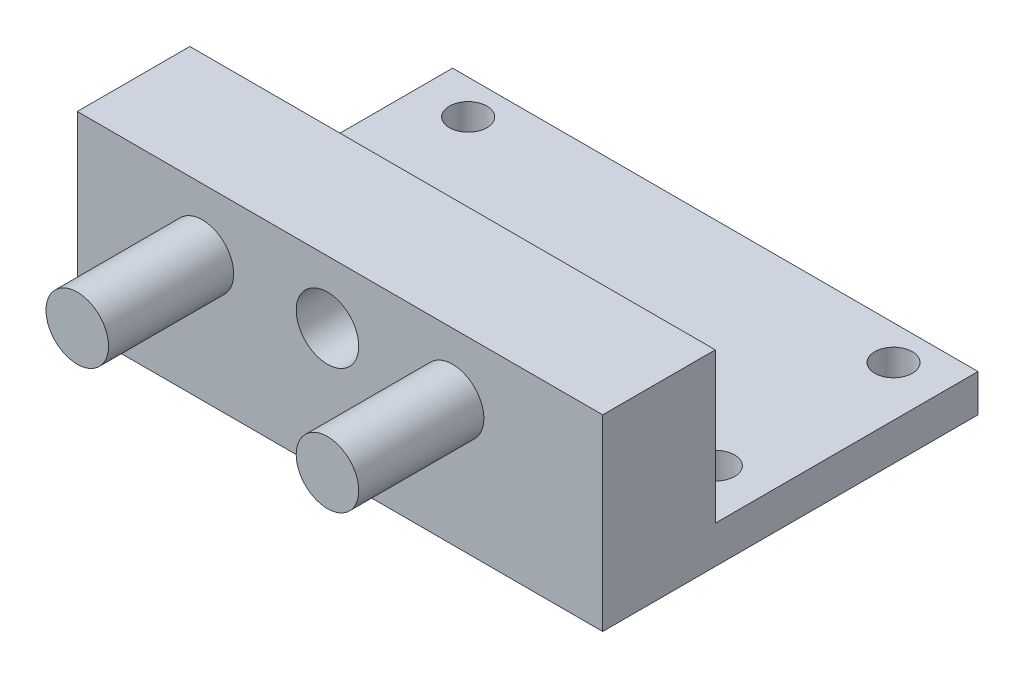
ISO-10303-21;
HEADER;
FILE_DESCRIPTION(('STEP AP214'),'2;1');
FILE_NAME('part.step','',(''),(''),'','','');
FILE_SCHEMA(('AUTOMOTIVE_DESIGN { 1 0 10303 214 1 1 1 1 }'));
ENDSEC;
DATA;
#1=APPLICATION_CONTEXT('core data for automotive mechanical design processes');
#2=APPLICATION_PROTOCOL_DEFINITION('international standard','automotive_design',2000,#1);
#3=PRODUCT_CONTEXT('',#1,'mechanical');
#4=PRODUCT('Part','Part','',(#3));
#5=PRODUCT_RELATED_PRODUCT_CATEGORY('part','',(#4));
#6=PRODUCT_DEFINITION_FORMATION('','',#4);
#7=PRODUCT_DEFINITION_CONTEXT('part definition',#1,'design');
#8=PRODUCT_DEFINITION('design','',#6,#7);
#9=PRODUCT_DEFINITION_SHAPE('','',#8);
#10=(LENGTH_UNIT() NAMED_UNIT(*) SI_UNIT(.MILLI.,.METRE.));
#11=(NAMED_UNIT(*) PLANE_ANGLE_UNIT() SI_UNIT($,.RADIAN.));
#12=(NAMED_UNIT(*) SI_UNIT($,.STERADIAN.) SOLID_ANGLE_UNIT());
#13=UNCERTAINTY_MEASURE_WITH_UNIT(LENGTH_MEASURE(1.E-05),#10,'distance_accuracy_value','');
#14=(GEOMETRIC_REPRESENTATION_CONTEXT(3) GLOBAL_UNCERTAINTY_ASSIGNED_CONTEXT((#13)) GLOBAL_UNIT_ASSIGNED_CONTEXT((#10,
#11,#12)) REPRESENTATION_CONTEXT('',''));
#15=CARTESIAN_POINT('',(0.,0.,0.));
#16=DIRECTION('',(0.,0.,1.));
#17=DIRECTION('',(1.,0.,0.));
#18=AXIS2_PLACEMENT_3D('',#15,#16,#17);
#19=CARTESIAN_POINT('',(21.,3.,0.));
#20=DIRECTION('',(-1.,0.,0.));
#21=DIRECTION('',(0.,0.,1.));
#22=AXIS2_PLACEMENT_3D('',#19,#20,#21);
#23=PLANE('',#22);
#24=DIRECTION('',(0.,0.,-1.));
#25=VECTOR('',#24,1.);
#26=CARTESIAN_POINT('',(21.,0.,0.));
#27=LINE('',#26,#25);
#28=CARTESIAN_POINT('',(21.,0.,15.));
#29=VERTEX_POINT('',#28);
#30=CARTESIAN_POINT('',(21.,0.,-15.));
#31=VERTEX_POINT('',#30);
#32=EDGE_CURVE('E139',#29,#31,#27,.T.);
#33=ORIENTED_EDGE('',*,*,#32,.T.);
#34=DIRECTION('',(0.,-1.,0.));
#35=VECTOR('',#34,1.);
#36=CARTESIAN_POINT('',(21.,3.,-15.));
#37=LINE('',#36,#35);
#38=CARTESIAN_POINT('',(21.,3.,-15.));
#39=VERTEX_POINT('',#38);
#40=EDGE_CURVE('E69',#39,#31,#37,.T.);
#41=ORIENTED_EDGE('',*,*,#40,.F.);
#42=DIRECTION('',(0.,0.,-1.));
#43=VECTOR('',#42,1.);
#44=CARTESIAN_POINT('',(21.,3.,0.));
#45=LINE('',#44,#43);
#46=CARTESIAN_POINT('',(21.,3.,6.));
#47=VERTEX_POINT('',#46);
#48=EDGE_CURVE('E100',#47,#39,#45,.T.);
#49=ORIENTED_EDGE('',*,*,#48,.F.);
#50=DIRECTION('',(0.,-1.,0.));
#51=VECTOR('',#50,1.);
#52=CARTESIAN_POINT('',(21.,15.,6.));
#53=LINE('',#52,#51);
#54=CARTESIAN_POINT('',(21.,15.,6.));
#55=VERTEX_POINT('',#54);
#56=EDGE_CURVE('E88',#55,#47,#53,.T.);
#57=ORIENTED_EDGE('',*,*,#56,.F.);
#58=DIRECTION('',(0.,0.,-1.));
#59=VECTOR('',#58,1.);
#60=CARTESIAN_POINT('',(21.,15.,0.));
#61=LINE('',#60,#59);
#62=CARTESIAN_POINT('',(21.,15.,15.));
#63=VERTEX_POINT('',#62);
#64=EDGE_CURVE('E189',#63,#55,#61,.T.);
#65=ORIENTED_EDGE('',*,*,#64,.F.);
#66=DIRECTION('',(0.,-1.,0.));
#67=VECTOR('',#66,1.);
#68=CARTESIAN_POINT('',(21.,15.,15.));
#69=LINE('',#68,#67);
#70=EDGE_CURVE('E97',#63,#29,#69,.T.);
#71=ORIENTED_EDGE('',*,*,#70,.T.);
#72=EDGE_LOOP('',(#33,#41,#49,#57,#65,#71));
#73=FACE_BOUND('',#72,.T.);
#74=ADVANCED_FACE('F41',(#73),#23,.F.);
#75=CARTESIAN_POINT('',(0.,3.,-15.));
#76=DIRECTION('',(0.,0.,-1.));
#77=DIRECTION('',(-1.,0.,0.));
#78=AXIS2_PLACEMENT_3D('',#75,#76,#77);
#79=PLANE('',#78);
#80=DIRECTION('',(1.,0.,0.));
#81=VECTOR('',#80,1.);
#82=CARTESIAN_POINT('',(0.,0.,-15.));
#83=LINE('',#82,#81);
#84=CARTESIAN_POINT('',(-21.,0.,-15.));
#85=VERTEX_POINT('',#84);
#86=EDGE_CURVE('E142',#85,#31,#83,.T.);
#87=ORIENTED_EDGE('',*,*,#86,.F.);
#88=DIRECTION('',(0.,-1.,0.));
#89=VECTOR('',#88,1.);
#90=CARTESIAN_POINT('',(-21.,3.,-15.));
#91=LINE('',#90,#89);
#92=CARTESIAN_POINT('',(-21.,3.,-15.));
#93=VERTEX_POINT('',#92);
#94=EDGE_CURVE('E59',#93,#85,#91,.T.);
#95=ORIENTED_EDGE('',*,*,#94,.F.);
#96=DIRECTION('',(1.,0.,0.));
#97=VECTOR('',#96,1.);
#98=CARTESIAN_POINT('',(0.,3.,-15.));
#99=LINE('',#98,#97);
#100=EDGE_CURVE('E103',#93,#39,#99,.T.);
#101=ORIENTED_EDGE('',*,*,#100,.T.);
#102=ORIENTED_EDGE('',*,*,#40,.T.);
#103=EDGE_LOOP('',(#87,#95,#101,#102));
#104=FACE_BOUND('',#103,.T.);
#105=ADVANCED_FACE('F244',(#104),#79,.T.);
#106=CARTESIAN_POINT('',(-21.,3.,0.));
#107=DIRECTION('',(-1.,0.,0.));
#108=DIRECTION('',(0.,0.,1.));
#109=AXIS2_PLACEMENT_3D('',#106,#107,#108);
#110=PLANE('',#109);
#111=DIRECTION('',(0.,0.,-1.));
#112=VECTOR('',#111,1.);
#113=CARTESIAN_POINT('',(-21.,0.,0.));
#114=LINE('',#113,#112);
#115=CARTESIAN_POINT('',(-21.,0.,15.));
#116=VERTEX_POINT('',#115);
#117=EDGE_CURVE('E146',#116,#85,#114,.T.);
#118=ORIENTED_EDGE('',*,*,#117,.F.);
#119=DIRECTION('',(0.,-1.,0.));
#120=VECTOR('',#119,1.);
#121=CARTESIAN_POINT('',(-21.,15.,15.));
#122=LINE('',#121,#120);
#123=CARTESIAN_POINT('',(-21.,15.,15.));
#124=VERTEX_POINT('',#123);
#125=EDGE_CURVE('E179',#124,#116,#122,.T.);
#126=ORIENTED_EDGE('',*,*,#125,.F.);
#127=DIRECTION('',(0.,0.,-1.));
#128=VECTOR('',#127,1.);
#129=CARTESIAN_POINT('',(-21.,15.,0.));
#130=LINE('',#129,#128);
#131=CARTESIAN_POINT('',(-21.,15.,6.));
#132=VERTEX_POINT('',#131);
#133=EDGE_CURVE('E196',#124,#132,#130,.T.);
#134=ORIENTED_EDGE('',*,*,#133,.T.);
#135=DIRECTION('',(0.,-1.,0.));
#136=VECTOR('',#135,1.);
#137=CARTESIAN_POINT('',(-21.,15.,6.));
#138=LINE('',#137,#136);
#139=CARTESIAN_POINT('',(-21.,3.,6.));
#140=VERTEX_POINT('',#139);
#141=EDGE_CURVE('E98',#132,#140,#138,.T.);
#142=ORIENTED_EDGE('',*,*,#141,.T.);
#143=DIRECTION('',(0.,0.,-1.));
#144=VECTOR('',#143,1.);
#145=CARTESIAN_POINT('',(-21.,3.,0.));
#146=LINE('',#145,#144);
#147=EDGE_CURVE('E109',#140,#93,#146,.T.);
#148=ORIENTED_EDGE('',*,*,#147,.T.);
#149=ORIENTED_EDGE('',*,*,#94,.T.);
#150=EDGE_LOOP('',(#118,#126,#134,#142,#148,#149));
#151=FACE_BOUND('',#150,.T.);
#152=ADVANCED_FACE('F224',(#151),#110,.T.);
#153=CARTESIAN_POINT('',(-17.,3.,-12.248496993988));
#154=DIRECTION('',(0.,-1.,0.));
#155=DIRECTION('',(0.,0.,-1.));
#156=AXIS2_PLACEMENT_3D('',#153,#154,#155);
#157=CYLINDRICAL_SURFACE('',#156,1.5);
#158=CARTESIAN_POINT('',(-17.,3.,-12.248496993988));
#159=DIRECTION('',(0.,1.,0.));
#160=DIRECTION('',(0.,0.,1.));
#161=AXIS2_PLACEMENT_3D('',#158,#159,#160);
#162=CIRCLE('',#161,1.5);
#163=CARTESIAN_POINT('',(-17.,3.,-10.748496993988));
#164=VERTEX_POINT('',#163);
#165=EDGE_CURVE('E111',#164,#164,#162,.T.);
#166=ORIENTED_EDGE('',*,*,#165,.T.);
#167=EDGE_LOOP('',(#166));
#168=FACE_BOUND('',#167,.T.);
#169=CARTESIAN_POINT('',(-17.,0.,-12.248496993988));
#170=DIRECTION('',(0.,1.,0.));
#171=DIRECTION('',(0.,0.,1.));
#172=AXIS2_PLACEMENT_3D('',#169,#170,#171);
#173=CIRCLE('',#172,1.5);
#174=CARTESIAN_POINT('',(-17.,0.,-10.748496993988));
#175=VERTEX_POINT('',#174);
#176=EDGE_CURVE('E135',#175,#175,#173,.T.);
#177=ORIENTED_EDGE('',*,*,#176,.F.);
#178=EDGE_LOOP('',(#177));
#179=FACE_BOUND('',#178,.T.);
#180=ADVANCED_FACE('F221',(#168,#179),#157,.F.);
#181=CARTESIAN_POINT('',(-17.0440881763527,3.,2.));
#182=DIRECTION('',(0.,-1.,0.));
#183=DIRECTION('',(0.,0.,-1.));
#184=AXIS2_PLACEMENT_3D('',#181,#182,#183);
#185=CYLINDRICAL_SURFACE('',#184,1.5);
#186=CARTESIAN_POINT('',(-17.0440881763527,3.,2.));
#187=DIRECTION('',(0.,1.,0.));
#188=DIRECTION('',(0.,0.,1.));
#189=AXIS2_PLACEMENT_3D('',#186,#187,#188);
#190=CIRCLE('',#189,1.5);
#191=CARTESIAN_POINT('',(-17.0440881763527,3.,3.5));
#192=VERTEX_POINT('',#191);
#193=EDGE_CURVE('E115',#192,#192,#190,.T.);
#194=ORIENTED_EDGE('',*,*,#193,.T.);
#195=EDGE_LOOP('',(#194));
#196=FACE_BOUND('',#195,.T.);
#197=CARTESIAN_POINT('',(-17.0440881763527,0.,2.));
#198=DIRECTION('',(0.,1.,0.));
#199=DIRECTION('',(0.,0.,1.));
#200=AXIS2_PLACEMENT_3D('',#197,#198,#199);
#201=CIRCLE('',#200,1.5);
#202=CARTESIAN_POINT('',(-17.0440881763527,0.,3.5));
#203=VERTEX_POINT('',#202);
#204=EDGE_CURVE('E131',#203,#203,#201,.T.);
#205=ORIENTED_EDGE('',*,*,#204,.F.);
#206=EDGE_LOOP('',(#205));
#207=FACE_BOUND('',#206,.T.);
#208=ADVANCED_FACE('F210',(#196,#207),#185,.F.);
#209=CARTESIAN_POINT('',(17.0440881763527,3.,2.));
#210=DIRECTION('',(0.,-1.,0.));
#211=DIRECTION('',(0.,0.,-1.));
#212=AXIS2_PLACEMENT_3D('',#209,#210,#211);
#213=CYLINDRICAL_SURFACE('',#212,1.5);
#214=CARTESIAN_POINT('',(17.0440881763527,3.,2.));
#215=DIRECTION('',(0.,1.,0.));
#216=DIRECTION('',(0.,0.,1.));
#217=AXIS2_PLACEMENT_3D('',#214,#215,#216);
#218=CIRCLE('',#217,1.5);
#219=CARTESIAN_POINT('',(17.0440881763527,3.,3.5));
#220=VERTEX_POINT('',#219);
#221=EDGE_CURVE('E154',#220,#220,#218,.F.);
#222=ORIENTED_EDGE('',*,*,#221,.F.);
#223=EDGE_LOOP('',(#222));
#224=FACE_BOUND('',#223,.T.);
#225=CARTESIAN_POINT('',(17.0440881763527,0.,2.));
#226=DIRECTION('',(0.,1.,0.));
#227=DIRECTION('',(0.,0.,1.));
#228=AXIS2_PLACEMENT_3D('',#225,#226,#227);
#229=CIRCLE('',#228,1.5);
#230=CARTESIAN_POINT('',(17.0440881763527,0.,3.5));
#231=VERTEX_POINT('',#230);
#232=EDGE_CURVE('E127',#231,#231,#229,.F.);
#233=ORIENTED_EDGE('',*,*,#232,.T.);
#234=EDGE_LOOP('',(#233));
#235=FACE_BOUND('',#234,.T.);
#236=ADVANCED_FACE('F43',(#224,#235),#213,.F.);
#237=CARTESIAN_POINT('',(17.,3.,-12.248496993988));
#238=DIRECTION('',(0.,-1.,0.));
#239=DIRECTION('',(0.,0.,-1.));
#240=AXIS2_PLACEMENT_3D('',#237,#238,#239);
#241=CYLINDRICAL_SURFACE('',#240,1.5);
#242=CARTESIAN_POINT('',(17.,3.,-12.248496993988));
#243=DIRECTION('',(0.,1.,0.));
#244=DIRECTION('',(0.,0.,1.));
#245=AXIS2_PLACEMENT_3D('',#242,#243,#244);
#246=CIRCLE('',#245,1.5);
#247=CARTESIAN_POINT('',(17.,3.,-10.748496993988));
#248=VERTEX_POINT('',#247);
#249=EDGE_CURVE('E123',#248,#248,#246,.F.);
#250=ORIENTED_EDGE('',*,*,#249,.F.);
#251=EDGE_LOOP('',(#250));
#252=FACE_BOUND('',#251,.T.);
#253=CARTESIAN_POINT('',(17.,0.,-12.248496993988));
#254=DIRECTION('',(0.,1.,0.));
#255=DIRECTION('',(0.,0.,1.));
#256=AXIS2_PLACEMENT_3D('',#253,#254,#255);
#257=CIRCLE('',#256,1.5);
#258=CARTESIAN_POINT('',(17.,0.,-10.748496993988));
#259=VERTEX_POINT('',#258);
#260=EDGE_CURVE('E150',#259,#259,#257,.F.);
#261=ORIENTED_EDGE('',*,*,#260,.T.);
#262=EDGE_LOOP('',(#261));
#263=FACE_BOUND('',#262,.T.);
#264=ADVANCED_FACE('F216',(#252,#263),#241,.F.);
#265=CARTESIAN_POINT('',(0.,3.,0.));
#266=DIRECTION('',(0.,1.,0.));
#267=DIRECTION('',(0.,0.,1.));
#268=AXIS2_PLACEMENT_3D('',#265,#266,#267);
#269=PLANE('',#268);
#270=ORIENTED_EDGE('',*,*,#221,.T.);
#271=EDGE_LOOP('',(#270));
#272=FACE_BOUND('',#271,.T.);
#273=ORIENTED_EDGE('',*,*,#193,.F.);
#274=EDGE_LOOP('',(#273));
#275=FACE_BOUND('',#274,.T.);
#276=ORIENTED_EDGE('',*,*,#165,.F.);
#277=EDGE_LOOP('',(#276));
#278=FACE_BOUND('',#277,.T.);
#279=DIRECTION('',(1.,0.,0.));
#280=VECTOR('',#279,1.);
#281=CARTESIAN_POINT('',(0.,3.,6.));
#282=LINE('',#281,#280);
#283=EDGE_CURVE('E78',#140,#47,#282,.T.);
#284=ORIENTED_EDGE('',*,*,#283,.T.);
#285=ORIENTED_EDGE('',*,*,#48,.T.);
#286=ORIENTED_EDGE('',*,*,#100,.F.);
#287=ORIENTED_EDGE('',*,*,#147,.F.);
#288=EDGE_LOOP('',(#284,#285,#286,#287));
#289=FACE_BOUND('',#288,.T.);
#290=ORIENTED_EDGE('',*,*,#249,.T.);
#291=EDGE_LOOP('',(#290));
#292=FACE_BOUND('',#291,.T.);
#293=ADVANCED_FACE('F106',(#272,#275,#278,#289,#292),#269,.T.);
#294=CARTESIAN_POINT('',(0.,0.,0.));
#295=DIRECTION('',(0.,1.,0.));
#296=DIRECTION('',(0.,0.,1.));
#297=AXIS2_PLACEMENT_3D('',#294,#295,#296);
#298=PLANE('',#297);
#299=ORIENTED_EDGE('',*,*,#232,.F.);
#300=EDGE_LOOP('',(#299));
#301=FACE_BOUND('',#300,.T.);
#302=ORIENTED_EDGE('',*,*,#204,.T.);
#303=EDGE_LOOP('',(#302));
#304=FACE_BOUND('',#303,.T.);
#305=ORIENTED_EDGE('',*,*,#176,.T.);
#306=EDGE_LOOP('',(#305));
#307=FACE_BOUND('',#306,.T.);
#308=ORIENTED_EDGE('',*,*,#32,.F.);
#309=DIRECTION('',(1.,0.,0.));
#310=VECTOR('',#309,1.);
#311=CARTESIAN_POINT('',(0.,0.,15.));
#312=LINE('',#311,#310);
#313=EDGE_CURVE('E175',#116,#29,#312,.T.);
#314=ORIENTED_EDGE('',*,*,#313,.F.);
#315=ORIENTED_EDGE('',*,*,#117,.T.);
#316=ORIENTED_EDGE('',*,*,#86,.T.);
#317=EDGE_LOOP('',(#308,#314,#315,#316));
#318=FACE_BOUND('',#317,.T.);
#319=ORIENTED_EDGE('',*,*,#260,.F.);
#320=EDGE_LOOP('',(#319));
#321=FACE_BOUND('',#320,.T.);
#322=ADVANCED_FACE('F215',(#301,#304,#307,#318,#321),#298,.F.);
#323=CARTESIAN_POINT('',(0.,15.,6.));
#324=DIRECTION('',(0.,0.,-1.));
#325=DIRECTION('',(-1.,0.,0.));
#326=AXIS2_PLACEMENT_3D('',#323,#324,#325);
#327=PLANE('',#326);
#328=CARTESIAN_POINT('',(-1.,10.,6.));
#329=DIRECTION('',(0.,0.,-1.));
#330=DIRECTION('',(-1.,0.,0.));
#331=AXIS2_PLACEMENT_3D('',#328,#329,#330);
#332=CIRCLE('',#331,2.5);
#333=CARTESIAN_POINT('',(-3.5,10.,6.));
#334=VERTEX_POINT('',#333);
#335=EDGE_CURVE('E370',#334,#334,#332,.T.);
#336=ORIENTED_EDGE('',*,*,#335,.F.);
#337=EDGE_LOOP('',(#336));
#338=FACE_BOUND('',#337,.T.);
#339=ORIENTED_EDGE('',*,*,#283,.F.);
#340=ORIENTED_EDGE('',*,*,#141,.F.);
#341=DIRECTION('',(1.,0.,0.));
#342=VECTOR('',#341,1.);
#343=CARTESIAN_POINT('',(0.,15.,6.));
#344=LINE('',#343,#342);
#345=EDGE_CURVE('E93',#132,#55,#344,.T.);
#346=ORIENTED_EDGE('',*,*,#345,.T.);
#347=ORIENTED_EDGE('',*,*,#56,.T.);
#348=EDGE_LOOP('',(#339,#340,#346,#347));
#349=FACE_BOUND('',#348,.T.);
#350=ADVANCED_FACE('F90',(#338,#349),#327,.T.);
#351=CARTESIAN_POINT('',(0.,15.,15.));
#352=DIRECTION('',(0.,0.,-1.));
#353=DIRECTION('',(-1.,0.,0.));
#354=AXIS2_PLACEMENT_3D('',#351,#352,#353);
#355=PLANE('',#354);
#356=CARTESIAN_POINT('',(-1.,10.,15.));
#357=DIRECTION('',(0.,0.,1.));
#358=DIRECTION('',(1.,0.,0.));
#359=AXIS2_PLACEMENT_3D('',#356,#357,#358);
#360=CIRCLE('',#359,2.5);
#361=CARTESIAN_POINT('',(1.5,10.,15.));
#362=VERTEX_POINT('',#361);
#363=EDGE_CURVE('E373',#362,#362,#360,.T.);
#364=ORIENTED_EDGE('',*,*,#363,.F.);
#365=EDGE_LOOP('',(#364));
#366=FACE_BOUND('',#365,.T.);
#367=CARTESIAN_POINT('',(-11.,10.,15.));
#368=DIRECTION('',(0.,0.,-1.));
#369=DIRECTION('',(-1.,0.,0.));
#370=AXIS2_PLACEMENT_3D('',#367,#368,#369);
#371=CIRCLE('',#370,2.5);
#372=CARTESIAN_POINT('',(-13.5,10.,15.));
#373=VERTEX_POINT('',#372);
#374=EDGE_CURVE('E11',#373,#373,#371,.F.);
#375=ORIENTED_EDGE('',*,*,#374,.F.);
#376=EDGE_LOOP('',(#375));
#377=FACE_BOUND('',#376,.T.);
#378=CARTESIAN_POINT('',(9.,10.,15.));
#379=DIRECTION('',(0.,0.,-1.));
#380=DIRECTION('',(-1.,0.,0.));
#381=AXIS2_PLACEMENT_3D('',#378,#379,#380);
#382=CIRCLE('',#381,2.5);
#383=CARTESIAN_POINT('',(6.5,10.,15.));
#384=VERTEX_POINT('',#383);
#385=EDGE_CURVE('E51',#384,#384,#382,.F.);
#386=ORIENTED_EDGE('',*,*,#385,.F.);
#387=EDGE_LOOP('',(#386));
#388=FACE_BOUND('',#387,.T.);
#389=ORIENTED_EDGE('',*,*,#313,.T.);
#390=ORIENTED_EDGE('',*,*,#70,.F.);
#391=DIRECTION('',(1.,0.,0.));
#392=VECTOR('',#391,1.);
#393=CARTESIAN_POINT('',(0.,15.,15.));
#394=LINE('',#393,#392);
#395=EDGE_CURVE('E183',#124,#63,#394,.T.);
#396=ORIENTED_EDGE('',*,*,#395,.F.);
#397=ORIENTED_EDGE('',*,*,#125,.T.);
#398=EDGE_LOOP('',(#389,#390,#396,#397));
#399=FACE_BOUND('',#398,.T.);
#400=ADVANCED_FACE('F164',(#366,#377,#388,#399),#355,.F.);
#401=CARTESIAN_POINT('',(0.,15.,0.));
#402=DIRECTION('',(0.,1.,0.));
#403=DIRECTION('',(0.,0.,1.));
#404=AXIS2_PLACEMENT_3D('',#401,#402,#403);
#405=PLANE('',#404);
#406=ORIENTED_EDGE('',*,*,#395,.T.);
#407=ORIENTED_EDGE('',*,*,#64,.T.);
#408=ORIENTED_EDGE('',*,*,#345,.F.);
#409=ORIENTED_EDGE('',*,*,#133,.F.);
#410=EDGE_LOOP('',(#406,#407,#408,#409));
#411=FACE_BOUND('',#410,.T.);
#412=ADVANCED_FACE('F167',(#411),#405,.T.);
#413=CARTESIAN_POINT('',(9.,10.,25.));
#414=DIRECTION('',(0.,0.,-1.));
#415=DIRECTION('',(-1.,0.,0.));
#416=AXIS2_PLACEMENT_3D('',#413,#414,#415);
#417=CYLINDRICAL_SURFACE('',#416,2.5);
#418=CARTESIAN_POINT('',(9.,10.,25.));
#419=DIRECTION('',(0.,0.,1.));
#420=DIRECTION('',(1.,0.,0.));
#421=AXIS2_PLACEMENT_3D('',#418,#419,#420);
#422=CIRCLE('',#421,2.5);
#423=CARTESIAN_POINT('',(11.5,10.,25.));
#424=VERTEX_POINT('',#423);
#425=EDGE_CURVE('E184',#424,#424,#422,.T.);
#426=ORIENTED_EDGE('',*,*,#425,.F.);
#427=EDGE_LOOP('',(#426));
#428=FACE_BOUND('',#427,.T.);
#429=ORIENTED_EDGE('',*,*,#385,.T.);
#430=EDGE_LOOP('',(#429));
#431=FACE_BOUND('',#430,.T.);
#432=ADVANCED_FACE('F162',(#428,#431),#417,.T.);
#433=CARTESIAN_POINT('',(0.,0.,25.));
#434=DIRECTION('',(0.,0.,1.));
#435=DIRECTION('',(1.,0.,0.));
#436=AXIS2_PLACEMENT_3D('',#433,#434,#435);
#437=PLANE('',#436);
#438=ORIENTED_EDGE('',*,*,#425,.T.);
#439=EDGE_LOOP('',(#438));
#440=FACE_BOUND('',#439,.T.);
#441=ADVANCED_FACE('F311',(#440),#437,.T.);
#442=CARTESIAN_POINT('',(-11.,10.,25.));
#443=DIRECTION('',(0.,0.,-1.));
#444=DIRECTION('',(-1.,0.,0.));
#445=AXIS2_PLACEMENT_3D('',#442,#443,#444);
#446=CYLINDRICAL_SURFACE('',#445,2.5);
#447=CARTESIAN_POINT('',(-11.,10.,25.));
#448=DIRECTION('',(0.,0.,1.));
#449=DIRECTION('',(1.,0.,0.));
#450=AXIS2_PLACEMENT_3D('',#447,#448,#449);
#451=CIRCLE('',#450,2.5);
#452=CARTESIAN_POINT('',(-8.5,10.,25.));
#453=VERTEX_POINT('',#452);
#454=EDGE_CURVE('E192',#453,#453,#451,.T.);
#455=ORIENTED_EDGE('',*,*,#454,.F.);
#456=EDGE_LOOP('',(#455));
#457=FACE_BOUND('',#456,.T.);
#458=ORIENTED_EDGE('',*,*,#374,.T.);
#459=EDGE_LOOP('',(#458));
#460=FACE_BOUND('',#459,.T.);
#461=ADVANCED_FACE('F321',(#457,#460),#446,.T.);
#462=CARTESIAN_POINT('',(-11.,10.,25.));
#463=DIRECTION('',(0.,0.,1.));
#464=DIRECTION('',(1.,0.,0.));
#465=AXIS2_PLACEMENT_3D('',#462,#463,#464);
#466=PLANE('',#465);
#467=ORIENTED_EDGE('',*,*,#454,.T.);
#468=EDGE_LOOP('',(#467));
#469=FACE_BOUND('',#468,.T.);
#470=ADVANCED_FACE('F331',(#469),#466,.T.);
#471=CARTESIAN_POINT('',(-1.,10.,5.));
#472=DIRECTION('',(0.,0.,1.));
#473=DIRECTION('',(1.,0.,0.));
#474=AXIS2_PLACEMENT_3D('',#471,#472,#473);
#475=CYLINDRICAL_SURFACE('',#474,2.5);
#476=ORIENTED_EDGE('',*,*,#335,.T.);
#477=EDGE_LOOP('',(#476));
#478=FACE_BOUND('',#477,.T.);
#479=ORIENTED_EDGE('',*,*,#363,.T.);
#480=EDGE_LOOP('',(#479));
#481=FACE_BOUND('',#480,.T.);
#482=ADVANCED_FACE('F341',(#478,#481),#475,.F.);
#483=CLOSED_SHELL('',(#74,#105,#152,#180,#208,#236,#264,#293,#322,#350,#400,#412,#432,#441,#461,
#470,#482));
#484=MANIFOLD_SOLID_BREP('B2',#483);
#485=ADVANCED_BREP_SHAPE_REPRESENTATION('',(#18,#484),#14);
#486=SHAPE_DEFINITION_REPRESENTATION(#9,#485);
ENDSEC;
END-ISO-10303-21;
